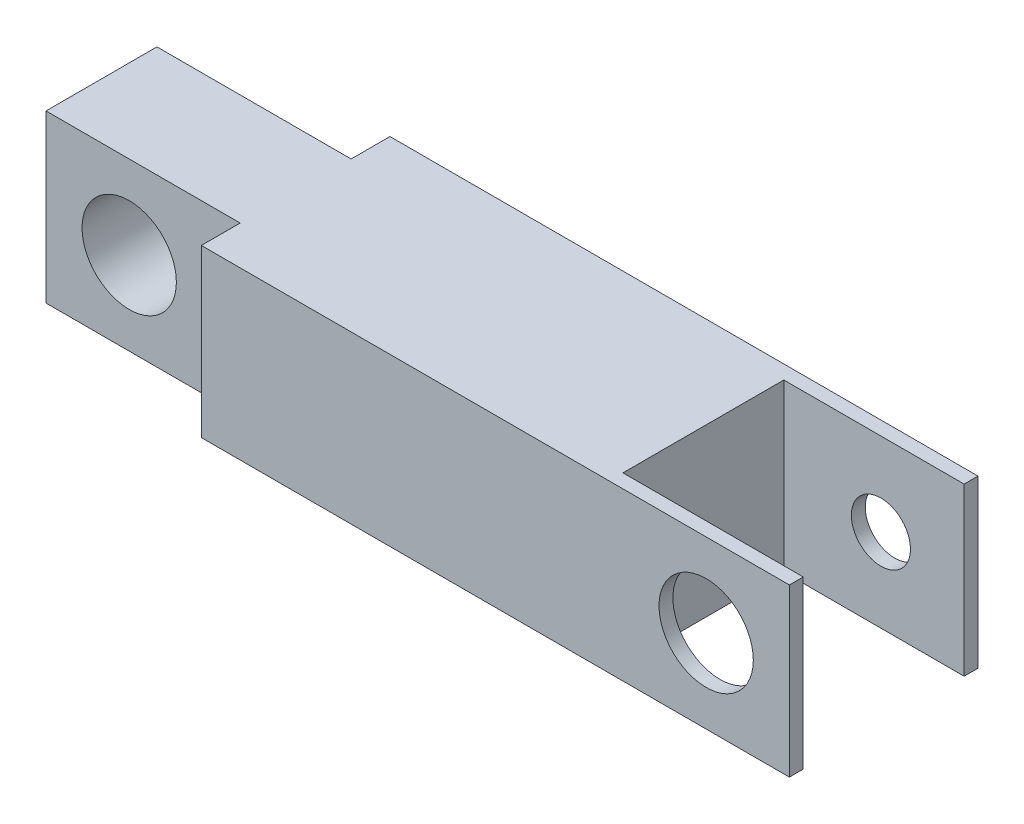
ISO-10303-21;
HEADER;
FILE_DESCRIPTION(('STEP AP214'),'2;1');
FILE_NAME('part.step','',(''),(''),'','','');
FILE_SCHEMA(('AUTOMOTIVE_DESIGN { 1 0 10303 214 1 1 1 1 }'));
ENDSEC;
DATA;
#1=APPLICATION_CONTEXT('core data for automotive mechanical design processes');
#2=APPLICATION_PROTOCOL_DEFINITION('international standard','automotive_design',2000,#1);
#3=PRODUCT_CONTEXT('',#1,'mechanical');
#4=PRODUCT('Part','Part','',(#3));
#5=PRODUCT_RELATED_PRODUCT_CATEGORY('part','',(#4));
#6=PRODUCT_DEFINITION_FORMATION('','',#4);
#7=PRODUCT_DEFINITION_CONTEXT('part definition',#1,'design');
#8=PRODUCT_DEFINITION('design','',#6,#7);
#9=PRODUCT_DEFINITION_SHAPE('','',#8);
#10=(LENGTH_UNIT() NAMED_UNIT(*) SI_UNIT(.MILLI.,.METRE.));
#11=(NAMED_UNIT(*) PLANE_ANGLE_UNIT() SI_UNIT($,.RADIAN.));
#12=(NAMED_UNIT(*) SI_UNIT($,.STERADIAN.) SOLID_ANGLE_UNIT());
#13=UNCERTAINTY_MEASURE_WITH_UNIT(LENGTH_MEASURE(1.E-05),#10,'distance_accuracy_value','');
#14=(GEOMETRIC_REPRESENTATION_CONTEXT(3) GLOBAL_UNCERTAINTY_ASSIGNED_CONTEXT((#13)) GLOBAL_UNIT_ASSIGNED_CONTEXT((#10,
#11,#12)) REPRESENTATION_CONTEXT('',''));
#15=CARTESIAN_POINT('',(0.,0.,0.));
#16=DIRECTION('',(0.,0.,1.));
#17=DIRECTION('',(1.,0.,0.));
#18=AXIS2_PLACEMENT_3D('',#15,#16,#17);
#19=CARTESIAN_POINT('',(-3.28308510638297,-3.18175531914893,8.636));
#20=DIRECTION('',(-1.,0.,0.));
#21=DIRECTION('',(0.,0.,1.));
#22=AXIS2_PLACEMENT_3D('',#19,#20,#21);
#23=PLANE('',#22);
#24=DIRECTION('',(0.,0.,-1.));
#25=VECTOR('',#24,1.);
#26=CARTESIAN_POINT('',(-3.28308510638297,-3.18175531914893,8.636));
#27=LINE('',#26,#25);
#28=CARTESIAN_POINT('',(-3.28308510638297,-3.18175531914893,8.636));
#29=VERTEX_POINT('',#28);
#30=CARTESIAN_POINT('',(-3.28308510638297,-3.18175531914894,8.001));
#31=VERTEX_POINT('',#30);
#32=EDGE_CURVE('E253',#29,#31,#27,.T.);
#33=ORIENTED_EDGE('',*,*,#32,.T.);
#34=DIRECTION('',(0.,1.,0.));
#35=VECTOR('',#34,1.);
#36=CARTESIAN_POINT('',(-3.28308510638297,-3.18175531914894,8.001));
#37=LINE('',#36,#35);
#38=CARTESIAN_POINT('',(-3.28308510638297,4.43824468085106,8.001));
#39=VERTEX_POINT('',#38);
#40=EDGE_CURVE('E172',#31,#39,#37,.T.);
#41=ORIENTED_EDGE('',*,*,#40,.T.);
#42=DIRECTION('',(0.,0.,-1.));
#43=VECTOR('',#42,1.);
#44=CARTESIAN_POINT('',(-3.28308510638297,4.43824468085106,8.636));
#45=LINE('',#44,#43);
#46=CARTESIAN_POINT('',(-3.28308510638297,4.43824468085106,8.636));
#47=VERTEX_POINT('',#46);
#48=EDGE_CURVE('E249',#47,#39,#45,.T.);
#49=ORIENTED_EDGE('',*,*,#48,.F.);
#50=DIRECTION('',(0.,1.,0.));
#51=VECTOR('',#50,1.);
#52=CARTESIAN_POINT('',(-3.28308510638297,-3.18175531914893,8.636));
#53=LINE('',#52,#51);
#54=EDGE_CURVE('E236',#29,#47,#53,.T.);
#55=ORIENTED_EDGE('',*,*,#54,.F.);
#56=EDGE_LOOP('',(#33,#41,#49,#55));
#57=FACE_BOUND('',#56,.T.);
#58=ADVANCED_FACE('F42',(#57),#23,.F.);
#59=CARTESIAN_POINT('',(-3.28308510638297,4.43824468085106,8.636));
#60=DIRECTION('',(0.,-1.,0.));
#61=DIRECTION('',(1.,0.,0.));
#62=AXIS2_PLACEMENT_3D('',#59,#60,#61);
#63=PLANE('',#62);
#64=ORIENTED_EDGE('',*,*,#48,.T.);
#65=DIRECTION('',(1.,0.,0.));
#66=VECTOR('',#65,1.);
#67=CARTESIAN_POINT('',(-11.538085106383,4.43824468085106,8.001));
#68=LINE('',#67,#66);
#69=CARTESIAN_POINT('',(-11.538085106383,4.43824468085106,8.001));
#70=VERTEX_POINT('',#69);
#71=EDGE_CURVE('E157',#70,#39,#68,.T.);
#72=ORIENTED_EDGE('',*,*,#71,.F.);
#73=DIRECTION('',(0.,0.,1.));
#74=VECTOR('',#73,1.);
#75=CARTESIAN_POINT('',(-11.538085106383,4.43824468085106,0.635000000000001));
#76=LINE('',#75,#74);
#77=CARTESIAN_POINT('',(-11.538085106383,4.43824468085106,0.635000000000001));
#78=VERTEX_POINT('',#77);
#79=EDGE_CURVE('E160',#78,#70,#76,.T.);
#80=ORIENTED_EDGE('',*,*,#79,.F.);
#81=DIRECTION('',(-1.,0.,0.));
#82=VECTOR('',#81,1.);
#83=CARTESIAN_POINT('',(-3.28308510638297,4.43824468085106,0.635));
#84=LINE('',#83,#82);
#85=CARTESIAN_POINT('',(-3.28308510638297,4.43824468085106,0.635));
#86=VERTEX_POINT('',#85);
#87=EDGE_CURVE('E135',#86,#78,#84,.T.);
#88=ORIENTED_EDGE('',*,*,#87,.F.);
#89=CARTESIAN_POINT('',(-3.28308510638297,4.43824468085106,0.));
#90=VERTEX_POINT('',#89);
#91=EDGE_CURVE('E239',#86,#90,#45,.T.);
#92=ORIENTED_EDGE('',*,*,#91,.T.);
#93=DIRECTION('',(-1.,0.,0.));
#94=VECTOR('',#93,1.);
#95=CARTESIAN_POINT('',(-3.28308510638297,4.43824468085106,0.));
#96=LINE('',#95,#94);
#97=CARTESIAN_POINT('',(-30.207085106383,4.43824468085106,0.));
#98=VERTEX_POINT('',#97);
#99=EDGE_CURVE('E200',#90,#98,#96,.T.);
#100=ORIENTED_EDGE('',*,*,#99,.T.);
#101=DIRECTION('',(0.,0.,1.));
#102=VECTOR('',#101,1.);
#103=CARTESIAN_POINT('',(-30.207085106383,4.43824468085106,0.));
#104=LINE('',#103,#102);
#105=CARTESIAN_POINT('',(-30.207085106383,4.43824468085106,1.778));
#106=VERTEX_POINT('',#105);
#107=EDGE_CURVE('E185',#98,#106,#104,.T.);
#108=ORIENTED_EDGE('',*,*,#107,.T.);
#109=DIRECTION('',(-1.,0.,0.));
#110=VECTOR('',#109,1.);
#111=CARTESIAN_POINT('',(0.,4.43824468085106,1.778));
#112=LINE('',#111,#110);
#113=CARTESIAN_POINT('',(-39.097085106383,4.43824468085106,1.778));
#114=VERTEX_POINT('',#113);
#115=EDGE_CURVE('E189',#106,#114,#112,.T.);
#116=ORIENTED_EDGE('',*,*,#115,.T.);
#117=DIRECTION('',(0.,0.,-1.));
#118=VECTOR('',#117,1.);
#119=CARTESIAN_POINT('',(-39.097085106383,4.43824468085106,8.636));
#120=LINE('',#119,#118);
#121=CARTESIAN_POINT('',(-39.097085106383,4.43824468085106,6.858));
#122=VERTEX_POINT('',#121);
#123=EDGE_CURVE('E12',#122,#114,#120,.T.);
#124=ORIENTED_EDGE('',*,*,#123,.F.);
#125=DIRECTION('',(1.,0.,0.));
#126=VECTOR('',#125,1.);
#127=CARTESIAN_POINT('',(0.,4.43824468085106,6.858));
#128=LINE('',#127,#126);
#129=CARTESIAN_POINT('',(-30.207085106383,4.43824468085106,6.858));
#130=VERTEX_POINT('',#129);
#131=EDGE_CURVE('E217',#122,#130,#128,.T.);
#132=ORIENTED_EDGE('',*,*,#131,.T.);
#133=DIRECTION('',(0.,0.,1.));
#134=VECTOR('',#133,1.);
#135=CARTESIAN_POINT('',(-30.207085106383,4.43824468085106,0.));
#136=LINE('',#135,#134);
#137=CARTESIAN_POINT('',(-30.207085106383,4.43824468085106,8.636));
#138=VERTEX_POINT('',#137);
#139=EDGE_CURVE('E193',#130,#138,#136,.T.);
#140=ORIENTED_EDGE('',*,*,#139,.T.);
#141=DIRECTION('',(-1.,0.,0.));
#142=VECTOR('',#141,1.);
#143=CARTESIAN_POINT('',(-3.28308510638297,4.43824468085106,8.636));
#144=LINE('',#143,#142);
#145=EDGE_CURVE('E228',#47,#138,#144,.T.);
#146=ORIENTED_EDGE('',*,*,#145,.F.);
#147=EDGE_LOOP('',(#64,#72,#80,#88,#92,#100,#108,#116,#124,#132,#140,#146));
#148=FACE_BOUND('',#147,.T.);
#149=ADVANCED_FACE('F44',(#148),#63,.F.);
#150=CARTESIAN_POINT('',(-39.097085106383,4.43824468085106,8.636));
#151=DIRECTION('',(1.,0.,0.));
#152=DIRECTION('',(0.,0.,-1.));
#153=AXIS2_PLACEMENT_3D('',#150,#151,#152);
#154=PLANE('',#153);
#155=DIRECTION('',(0.,1.,0.));
#156=VECTOR('',#155,1.);
#157=CARTESIAN_POINT('',(-39.097085106383,-3.18175531914894,1.778));
#158=LINE('',#157,#156);
#159=CARTESIAN_POINT('',(-39.097085106383,-3.18175531914894,1.778));
#160=VERTEX_POINT('',#159);
#161=EDGE_CURVE('E197',#160,#114,#158,.T.);
#162=ORIENTED_EDGE('',*,*,#161,.F.);
#163=DIRECTION('',(0.,0.,-1.));
#164=VECTOR('',#163,1.);
#165=CARTESIAN_POINT('',(-39.097085106383,-3.18175531914893,8.636));
#166=LINE('',#165,#164);
#167=CARTESIAN_POINT('',(-39.097085106383,-3.18175531914894,6.858));
#168=VERTEX_POINT('',#167);
#169=EDGE_CURVE('E51',#168,#160,#166,.T.);
#170=ORIENTED_EDGE('',*,*,#169,.F.);
#171=DIRECTION('',(0.,1.,0.));
#172=VECTOR('',#171,1.);
#173=CARTESIAN_POINT('',(-39.097085106383,-3.18175531914894,6.858));
#174=LINE('',#173,#172);
#175=EDGE_CURVE('E211',#168,#122,#174,.T.);
#176=ORIENTED_EDGE('',*,*,#175,.T.);
#177=ORIENTED_EDGE('',*,*,#123,.T.);
#178=EDGE_LOOP('',(#162,#170,#176,#177));
#179=FACE_BOUND('',#178,.T.);
#180=ADVANCED_FACE('F264',(#179),#154,.F.);
#181=CARTESIAN_POINT('',(-39.097085106383,-3.18175531914893,8.636));
#182=DIRECTION('',(0.,1.,0.));
#183=DIRECTION('',(0.,0.,1.));
#184=AXIS2_PLACEMENT_3D('',#181,#182,#183);
#185=PLANE('',#184);
#186=DIRECTION('',(0.,0.,1.));
#187=VECTOR('',#186,1.);
#188=CARTESIAN_POINT('',(-11.538085106383,-3.18175531914894,0.635000000000001));
#189=LINE('',#188,#187);
#190=CARTESIAN_POINT('',(-11.538085106383,-3.18175531914894,0.635000000000001));
#191=VERTEX_POINT('',#190);
#192=CARTESIAN_POINT('',(-11.538085106383,-3.18175531914894,8.001));
#193=VERTEX_POINT('',#192);
#194=EDGE_CURVE('E144',#191,#193,#189,.T.);
#195=ORIENTED_EDGE('',*,*,#194,.T.);
#196=DIRECTION('',(1.,0.,0.));
#197=VECTOR('',#196,1.);
#198=CARTESIAN_POINT('',(-11.538085106383,-3.18175531914894,8.001));
#199=LINE('',#198,#197);
#200=EDGE_CURVE('E150',#193,#31,#199,.T.);
#201=ORIENTED_EDGE('',*,*,#200,.T.);
#202=ORIENTED_EDGE('',*,*,#32,.F.);
#203=DIRECTION('',(1.,0.,0.));
#204=VECTOR('',#203,1.);
#205=CARTESIAN_POINT('',(-39.097085106383,-3.18175531914893,8.636));
#206=LINE('',#205,#204);
#207=CARTESIAN_POINT('',(-30.207085106383,-3.18175531914893,8.636));
#208=VERTEX_POINT('',#207);
#209=EDGE_CURVE('E232',#208,#29,#206,.T.);
#210=ORIENTED_EDGE('',*,*,#209,.F.);
#211=DIRECTION('',(0.,0.,1.));
#212=VECTOR('',#211,1.);
#213=CARTESIAN_POINT('',(-30.207085106383,-3.18175531914894,0.));
#214=LINE('',#213,#212);
#215=CARTESIAN_POINT('',(-30.207085106383,-3.18175531914894,6.858));
#216=VERTEX_POINT('',#215);
#217=EDGE_CURVE('E66',#216,#208,#214,.T.);
#218=ORIENTED_EDGE('',*,*,#217,.F.);
#219=DIRECTION('',(1.,0.,0.));
#220=VECTOR('',#219,1.);
#221=CARTESIAN_POINT('',(0.,-3.18175531914893,6.858));
#222=LINE('',#221,#220);
#223=EDGE_CURVE('E210',#168,#216,#222,.T.);
#224=ORIENTED_EDGE('',*,*,#223,.F.);
#225=ORIENTED_EDGE('',*,*,#169,.T.);
#226=DIRECTION('',(-1.,0.,0.));
#227=VECTOR('',#226,1.);
#228=CARTESIAN_POINT('',(0.,-3.18175531914893,1.778));
#229=LINE('',#228,#227);
#230=CARTESIAN_POINT('',(-30.207085106383,-3.18175531914894,1.778));
#231=VERTEX_POINT('',#230);
#232=EDGE_CURVE('E181',#231,#160,#229,.T.);
#233=ORIENTED_EDGE('',*,*,#232,.F.);
#234=DIRECTION('',(0.,0.,1.));
#235=VECTOR('',#234,1.);
#236=CARTESIAN_POINT('',(-30.207085106383,-3.18175531914894,0.));
#237=LINE('',#236,#235);
#238=CARTESIAN_POINT('',(-30.207085106383,-3.18175531914894,0.));
#239=VERTEX_POINT('',#238);
#240=EDGE_CURVE('E184',#239,#231,#237,.T.);
#241=ORIENTED_EDGE('',*,*,#240,.F.);
#242=DIRECTION('',(1.,0.,0.));
#243=VECTOR('',#242,1.);
#244=CARTESIAN_POINT('',(-39.097085106383,-3.18175531914893,0.));
#245=LINE('',#244,#243);
#246=CARTESIAN_POINT('',(-3.28308510638297,-3.18175531914893,0.));
#247=VERTEX_POINT('',#246);
#248=EDGE_CURVE('E243',#239,#247,#245,.T.);
#249=ORIENTED_EDGE('',*,*,#248,.T.);
#250=CARTESIAN_POINT('',(-3.28308510638297,-3.18175531914893,0.635));
#251=VERTEX_POINT('',#250);
#252=EDGE_CURVE('E155',#251,#247,#27,.T.);
#253=ORIENTED_EDGE('',*,*,#252,.F.);
#254=DIRECTION('',(-1.,0.,0.));
#255=VECTOR('',#254,1.);
#256=CARTESIAN_POINT('',(-3.28308510638297,-3.18175531914894,0.635));
#257=LINE('',#256,#255);
#258=EDGE_CURVE('E58',#251,#191,#257,.T.);
#259=ORIENTED_EDGE('',*,*,#258,.T.);
#260=EDGE_LOOP('',(#195,#201,#202,#210,#218,#224,#225,#233,#241,#249,#253,#259));
#261=FACE_BOUND('',#260,.T.);
#262=ADVANCED_FACE('F153',(#261),#185,.F.);
#263=CARTESIAN_POINT('',(0.,0.,8.636));
#264=DIRECTION('',(0.,0.,1.));
#265=DIRECTION('',(1.,0.,0.));
#266=AXIS2_PLACEMENT_3D('',#263,#264,#265);
#267=PLANE('',#266);
#268=CARTESIAN_POINT('',(-7.09308510638297,0.628244680851066,8.636));
#269=DIRECTION('',(0.,0.,1.));
#270=DIRECTION('',(1.,0.,0.));
#271=AXIS2_PLACEMENT_3D('',#268,#269,#270);
#272=CIRCLE('',#271,2.159);
#273=CARTESIAN_POINT('',(-4.93408510638297,0.628244680851066,8.636));
#274=VERTEX_POINT('',#273);
#275=EDGE_CURVE('E338',#274,#274,#272,.T.);
#276=ORIENTED_EDGE('',*,*,#275,.F.);
#277=EDGE_LOOP('',(#276));
#278=FACE_BOUND('',#277,.T.);
#279=ORIENTED_EDGE('',*,*,#145,.T.);
#280=DIRECTION('',(0.,1.,0.));
#281=VECTOR('',#280,1.);
#282=CARTESIAN_POINT('',(-30.207085106383,-3.18175531914894,8.636));
#283=LINE('',#282,#281);
#284=EDGE_CURVE('E176',#208,#138,#283,.T.);
#285=ORIENTED_EDGE('',*,*,#284,.F.);
#286=ORIENTED_EDGE('',*,*,#209,.T.);
#287=ORIENTED_EDGE('',*,*,#54,.T.);
#288=EDGE_LOOP('',(#279,#285,#286,#287));
#289=FACE_BOUND('',#288,.T.);
#290=ADVANCED_FACE('F293',(#278,#289),#267,.T.);
#291=CARTESIAN_POINT('',(0.,0.,0.));
#292=DIRECTION('',(0.,0.,1.));
#293=DIRECTION('',(1.,0.,0.));
#294=AXIS2_PLACEMENT_3D('',#291,#292,#293);
#295=PLANE('',#294);
#296=CARTESIAN_POINT('',(-7.09308510638297,0.628244680851066,0.));
#297=DIRECTION('',(0.,0.,-1.));
#298=DIRECTION('',(-1.,0.,0.));
#299=AXIS2_PLACEMENT_3D('',#296,#297,#298);
#300=CIRCLE('',#299,1.35254999999999);
#301=CARTESIAN_POINT('',(-8.44563510638296,0.628244680851066,0.));
#302=VERTEX_POINT('',#301);
#303=EDGE_CURVE('E331',#302,#302,#300,.T.);
#304=ORIENTED_EDGE('',*,*,#303,.F.);
#305=EDGE_LOOP('',(#304));
#306=FACE_BOUND('',#305,.T.);
#307=DIRECTION('',(0.,1.,0.));
#308=VECTOR('',#307,1.);
#309=CARTESIAN_POINT('',(-30.207085106383,-3.18175531914894,0.));
#310=LINE('',#309,#308);
#311=EDGE_CURVE('E201',#239,#98,#310,.T.);
#312=ORIENTED_EDGE('',*,*,#311,.T.);
#313=ORIENTED_EDGE('',*,*,#99,.F.);
#314=DIRECTION('',(0.,1.,0.));
#315=VECTOR('',#314,1.);
#316=CARTESIAN_POINT('',(-3.28308510638297,-3.18175531914893,0.));
#317=LINE('',#316,#315);
#318=EDGE_CURVE('E233',#247,#90,#317,.T.);
#319=ORIENTED_EDGE('',*,*,#318,.F.);
#320=ORIENTED_EDGE('',*,*,#248,.F.);
#321=EDGE_LOOP('',(#312,#313,#319,#320));
#322=FACE_BOUND('',#321,.T.);
#323=ADVANCED_FACE('F276',(#306,#322),#295,.F.);
#324=ORIENTED_EDGE('',*,*,#91,.F.);
#325=DIRECTION('',(0.,1.,0.));
#326=VECTOR('',#325,1.);
#327=CARTESIAN_POINT('',(-3.28308510638297,-3.18175531914894,0.635));
#328=LINE('',#327,#326);
#329=EDGE_CURVE('E141',#251,#86,#328,.T.);
#330=ORIENTED_EDGE('',*,*,#329,.F.);
#331=ORIENTED_EDGE('',*,*,#252,.T.);
#332=ORIENTED_EDGE('',*,*,#318,.T.);
#333=EDGE_LOOP('',(#324,#330,#331,#332));
#334=FACE_BOUND('',#333,.T.);
#335=ADVANCED_FACE('F280',(#334),#23,.F.);
#336=CARTESIAN_POINT('',(0.,-3.18175531914893,1.778));
#337=DIRECTION('',(0.,0.,-1.));
#338=DIRECTION('',(-1.,0.,0.));
#339=AXIS2_PLACEMENT_3D('',#336,#337,#338);
#340=PLANE('',#339);
#341=CARTESIAN_POINT('',(-35.287085106383,0.628244680851066,1.778));
#342=DIRECTION('',(0.,0.,-1.));
#343=DIRECTION('',(-1.,0.,0.));
#344=AXIS2_PLACEMENT_3D('',#341,#342,#343);
#345=CIRCLE('',#344,2.159);
#346=CARTESIAN_POINT('',(-37.446085106383,0.628244680851066,1.778));
#347=VERTEX_POINT('',#346);
#348=EDGE_CURVE('E163',#347,#347,#345,.T.);
#349=ORIENTED_EDGE('',*,*,#348,.F.);
#350=EDGE_LOOP('',(#349));
#351=FACE_BOUND('',#350,.T.);
#352=ORIENTED_EDGE('',*,*,#115,.F.);
#353=DIRECTION('',(0.,1.,0.));
#354=VECTOR('',#353,1.);
#355=CARTESIAN_POINT('',(-30.207085106383,-3.18175531914894,1.778));
#356=LINE('',#355,#354);
#357=EDGE_CURVE('E188',#231,#106,#356,.T.);
#358=ORIENTED_EDGE('',*,*,#357,.F.);
#359=ORIENTED_EDGE('',*,*,#232,.T.);
#360=ORIENTED_EDGE('',*,*,#161,.T.);
#361=EDGE_LOOP('',(#352,#358,#359,#360));
#362=FACE_BOUND('',#361,.T.);
#363=ADVANCED_FACE('F268',(#351,#362),#340,.T.);
#364=CARTESIAN_POINT('',(-30.207085106383,-3.18175531914894,0.));
#365=DIRECTION('',(-1.,0.,0.));
#366=DIRECTION('',(0.,-1.,0.));
#367=AXIS2_PLACEMENT_3D('',#364,#365,#366);
#368=PLANE('',#367);
#369=ORIENTED_EDGE('',*,*,#107,.F.);
#370=ORIENTED_EDGE('',*,*,#311,.F.);
#371=ORIENTED_EDGE('',*,*,#240,.T.);
#372=ORIENTED_EDGE('',*,*,#357,.T.);
#373=EDGE_LOOP('',(#369,#370,#371,#372));
#374=FACE_BOUND('',#373,.T.);
#375=ADVANCED_FACE('F273',(#374),#368,.T.);
#376=CARTESIAN_POINT('',(-30.207085106383,-3.18175531914894,0.));
#377=DIRECTION('',(-1.,0.,0.));
#378=DIRECTION('',(0.,-1.,0.));
#379=AXIS2_PLACEMENT_3D('',#376,#377,#378);
#380=PLANE('',#379);
#381=ORIENTED_EDGE('',*,*,#139,.F.);
#382=DIRECTION('',(0.,1.,0.));
#383=VECTOR('',#382,1.);
#384=CARTESIAN_POINT('',(-30.207085106383,-3.18175531914894,6.858));
#385=LINE('',#384,#383);
#386=EDGE_CURVE('E207',#216,#130,#385,.T.);
#387=ORIENTED_EDGE('',*,*,#386,.F.);
#388=ORIENTED_EDGE('',*,*,#217,.T.);
#389=ORIENTED_EDGE('',*,*,#284,.T.);
#390=EDGE_LOOP('',(#381,#387,#388,#389));
#391=FACE_BOUND('',#390,.T.);
#392=ADVANCED_FACE('F295',(#391),#380,.T.);
#393=CARTESIAN_POINT('',(0.,-3.18175531914893,6.858));
#394=DIRECTION('',(0.,0.,1.));
#395=DIRECTION('',(1.,0.,0.));
#396=AXIS2_PLACEMENT_3D('',#393,#394,#395);
#397=PLANE('',#396);
#398=CARTESIAN_POINT('',(-35.287085106383,0.628244680851066,6.858));
#399=DIRECTION('',(0.,0.,1.));
#400=DIRECTION('',(1.,0.,0.));
#401=AXIS2_PLACEMENT_3D('',#398,#399,#400);
#402=CIRCLE('',#401,2.159);
#403=CARTESIAN_POINT('',(-33.128085106383,0.628244680851066,6.858));
#404=VERTEX_POINT('',#403);
#405=EDGE_CURVE('E347',#404,#404,#402,.T.);
#406=ORIENTED_EDGE('',*,*,#405,.F.);
#407=EDGE_LOOP('',(#406));
#408=FACE_BOUND('',#407,.T.);
#409=ORIENTED_EDGE('',*,*,#131,.F.);
#410=ORIENTED_EDGE('',*,*,#175,.F.);
#411=ORIENTED_EDGE('',*,*,#223,.T.);
#412=ORIENTED_EDGE('',*,*,#386,.T.);
#413=EDGE_LOOP('',(#409,#410,#411,#412));
#414=FACE_BOUND('',#413,.T.);
#415=ADVANCED_FACE('F297',(#408,#414),#397,.T.);
#416=CARTESIAN_POINT('',(-11.538085106383,-3.18175531914894,8.001));
#417=DIRECTION('',(0.,0.,1.));
#418=DIRECTION('',(1.,0.,0.));
#419=AXIS2_PLACEMENT_3D('',#416,#417,#418);
#420=PLANE('',#419);
#421=CARTESIAN_POINT('',(-7.09308510638297,0.628244680851066,8.001));
#422=DIRECTION('',(0.,0.,1.));
#423=DIRECTION('',(1.,0.,0.));
#424=AXIS2_PLACEMENT_3D('',#421,#422,#423);
#425=CIRCLE('',#424,2.159);
#426=CARTESIAN_POINT('',(-4.93408510638297,0.628244680851066,8.001));
#427=VERTEX_POINT('',#426);
#428=EDGE_CURVE('E344',#427,#427,#425,.F.);
#429=ORIENTED_EDGE('',*,*,#428,.F.);
#430=EDGE_LOOP('',(#429));
#431=FACE_BOUND('',#430,.T.);
#432=ORIENTED_EDGE('',*,*,#71,.T.);
#433=ORIENTED_EDGE('',*,*,#40,.F.);
#434=ORIENTED_EDGE('',*,*,#200,.F.);
#435=DIRECTION('',(0.,1.,0.));
#436=VECTOR('',#435,1.);
#437=CARTESIAN_POINT('',(-11.538085106383,-3.18175531914894,8.001));
#438=LINE('',#437,#436);
#439=EDGE_CURVE('E140',#193,#70,#438,.T.);
#440=ORIENTED_EDGE('',*,*,#439,.T.);
#441=EDGE_LOOP('',(#432,#433,#434,#440));
#442=FACE_BOUND('',#441,.T.);
#443=ADVANCED_FACE('F287',(#431,#442),#420,.F.);
#444=CARTESIAN_POINT('',(-11.538085106383,-3.18175531914894,0.635000000000001));
#445=DIRECTION('',(-1.,0.,0.));
#446=DIRECTION('',(0.,0.,1.));
#447=AXIS2_PLACEMENT_3D('',#444,#445,#446);
#448=PLANE('',#447);
#449=ORIENTED_EDGE('',*,*,#79,.T.);
#450=ORIENTED_EDGE('',*,*,#439,.F.);
#451=ORIENTED_EDGE('',*,*,#194,.F.);
#452=DIRECTION('',(0.,1.,0.));
#453=VECTOR('',#452,1.);
#454=CARTESIAN_POINT('',(-11.538085106383,-3.18175531914894,0.635000000000001));
#455=LINE('',#454,#453);
#456=EDGE_CURVE('E131',#191,#78,#455,.T.);
#457=ORIENTED_EDGE('',*,*,#456,.T.);
#458=EDGE_LOOP('',(#449,#450,#451,#457));
#459=FACE_BOUND('',#458,.T.);
#460=ADVANCED_FACE('F145',(#459),#448,.F.);
#461=CARTESIAN_POINT('',(-3.28308510638297,-3.18175531914894,0.635));
#462=DIRECTION('',(0.,0.,-1.));
#463=DIRECTION('',(-1.,0.,0.));
#464=AXIS2_PLACEMENT_3D('',#461,#462,#463);
#465=PLANE('',#464);
#466=CARTESIAN_POINT('',(-7.09308510638297,0.628244680851066,0.635000000000001));
#467=DIRECTION('',(0.,0.,-1.));
#468=DIRECTION('',(-1.,0.,0.));
#469=AXIS2_PLACEMENT_3D('',#466,#467,#468);
#470=CIRCLE('',#469,1.35254999999999);
#471=CARTESIAN_POINT('',(-8.44563510638296,0.628244680851066,0.635000000000001));
#472=VERTEX_POINT('',#471);
#473=EDGE_CURVE('E334',#472,#472,#470,.T.);
#474=ORIENTED_EDGE('',*,*,#473,.T.);
#475=EDGE_LOOP('',(#474));
#476=FACE_BOUND('',#475,.T.);
#477=ORIENTED_EDGE('',*,*,#87,.T.);
#478=ORIENTED_EDGE('',*,*,#456,.F.);
#479=ORIENTED_EDGE('',*,*,#258,.F.);
#480=ORIENTED_EDGE('',*,*,#329,.T.);
#481=EDGE_LOOP('',(#477,#478,#479,#480));
#482=FACE_BOUND('',#481,.T.);
#483=ADVANCED_FACE('F133',(#476,#482),#465,.F.);
#484=CARTESIAN_POINT('',(-35.287085106383,0.628244680851066,0.));
#485=DIRECTION('',(0.,0.,1.));
#486=DIRECTION('',(1.,0.,0.));
#487=AXIS2_PLACEMENT_3D('',#484,#485,#486);
#488=CYLINDRICAL_SURFACE('',#487,2.159);
#489=ORIENTED_EDGE('',*,*,#348,.T.);
#490=EDGE_LOOP('',(#489));
#491=FACE_BOUND('',#490,.T.);
#492=ORIENTED_EDGE('',*,*,#405,.T.);
#493=EDGE_LOOP('',(#492));
#494=FACE_BOUND('',#493,.T.);
#495=ADVANCED_FACE('F355',(#491,#494),#488,.F.);
#496=CARTESIAN_POINT('',(-7.09308510638297,0.628244680851066,-0.000999999999999265));
#497=DIRECTION('',(0.,0.,1.));
#498=DIRECTION('',(1.,0.,0.));
#499=AXIS2_PLACEMENT_3D('',#496,#497,#498);
#500=CYLINDRICAL_SURFACE('',#499,2.159);
#501=ORIENTED_EDGE('',*,*,#275,.T.);
#502=EDGE_LOOP('',(#501));
#503=FACE_BOUND('',#502,.T.);
#504=ORIENTED_EDGE('',*,*,#428,.T.);
#505=EDGE_LOOP('',(#504));
#506=FACE_BOUND('',#505,.T.);
#507=ADVANCED_FACE('F357',(#503,#506),#500,.F.);
#508=CARTESIAN_POINT('',(-7.09308510638297,0.628244680851066,0.));
#509=DIRECTION('',(0.,0.,-1.));
#510=DIRECTION('',(-1.,0.,0.));
#511=AXIS2_PLACEMENT_3D('',#508,#509,#510);
#512=CYLINDRICAL_SURFACE('',#511,1.35254999999999);
#513=ORIENTED_EDGE('',*,*,#473,.F.);
#514=EDGE_LOOP('',(#513));
#515=FACE_BOUND('',#514,.T.);
#516=ORIENTED_EDGE('',*,*,#303,.T.);
#517=EDGE_LOOP('',(#516));
#518=FACE_BOUND('',#517,.T.);
#519=ADVANCED_FACE('F363',(#515,#518),#512,.F.);
#520=CLOSED_SHELL('',(#58,#149,#180,#262,#290,#323,#335,#363,#375,#392,#415,#443,#460,#483,#495,
#507,#519));
#521=MANIFOLD_SOLID_BREP('B2',#520);
#522=ADVANCED_BREP_SHAPE_REPRESENTATION('',(#18,#521),#14);
#523=SHAPE_DEFINITION_REPRESENTATION(#9,#522);
ENDSEC;
END-ISO-10303-21;
